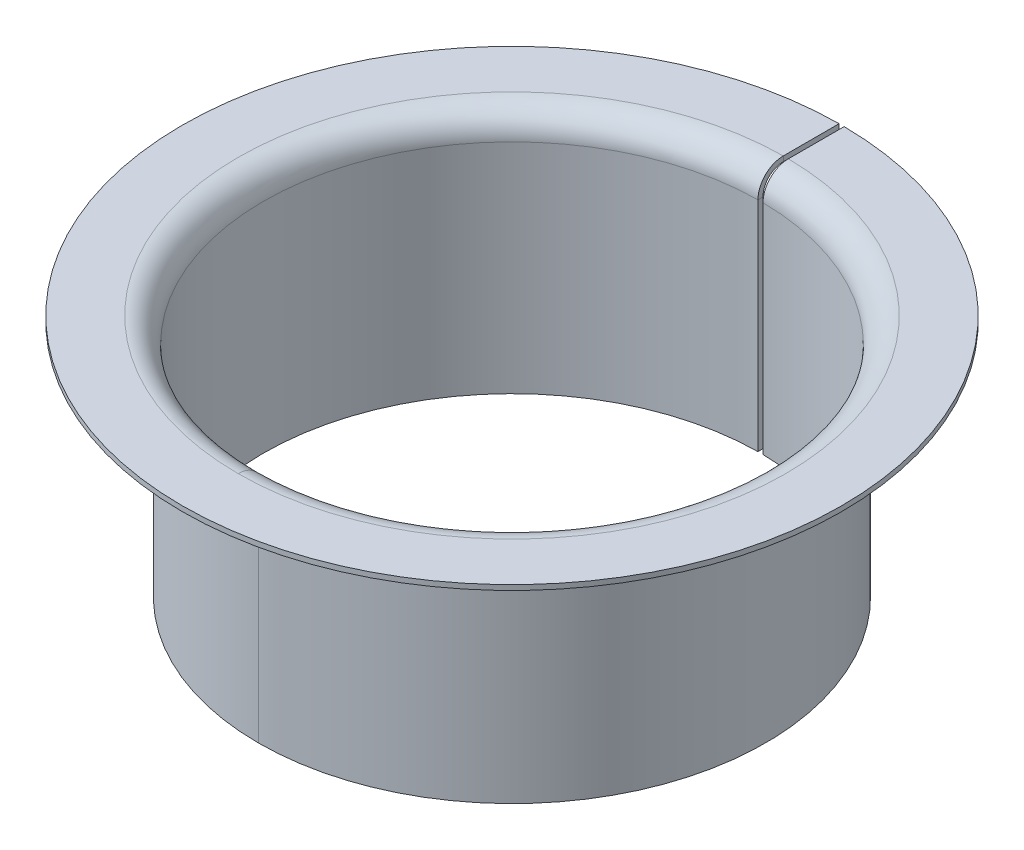
ISO-10303-21;
HEADER;
FILE_DESCRIPTION(('STEP AP214'),'2;1');
FILE_NAME('part.step','',(''),(''),'','','');
FILE_SCHEMA(('AUTOMOTIVE_DESIGN { 1 0 10303 214 1 1 1 1 }'));
ENDSEC;
DATA;
#1=APPLICATION_CONTEXT('core data for automotive mechanical design processes');
#2=APPLICATION_PROTOCOL_DEFINITION('international standard','automotive_design',2000,#1);
#3=PRODUCT_CONTEXT('',#1,'mechanical');
#4=PRODUCT('Part','Part','',(#3));
#5=PRODUCT_RELATED_PRODUCT_CATEGORY('part','',(#4));
#6=PRODUCT_DEFINITION_FORMATION('','',#4);
#7=PRODUCT_DEFINITION_CONTEXT('part definition',#1,'design');
#8=PRODUCT_DEFINITION('design','',#6,#7);
#9=PRODUCT_DEFINITION_SHAPE('','',#8);
#10=(LENGTH_UNIT() NAMED_UNIT(*) SI_UNIT(.MILLI.,.METRE.));
#11=(NAMED_UNIT(*) PLANE_ANGLE_UNIT() SI_UNIT($,.RADIAN.));
#12=(NAMED_UNIT(*) SI_UNIT($,.STERADIAN.) SOLID_ANGLE_UNIT());
#13=UNCERTAINTY_MEASURE_WITH_UNIT(LENGTH_MEASURE(1.E-05),#10,'distance_accuracy_value','');
#14=(GEOMETRIC_REPRESENTATION_CONTEXT(3) GLOBAL_UNCERTAINTY_ASSIGNED_CONTEXT((#13)) GLOBAL_UNIT_ASSIGNED_CONTEXT((#10,
#11,#12)) REPRESENTATION_CONTEXT('',''));
#15=CARTESIAN_POINT('',(0.,0.,0.));
#16=DIRECTION('',(0.,0.,1.));
#17=DIRECTION('',(1.,0.,0.));
#18=AXIS2_PLACEMENT_3D('',#15,#16,#17);
#19=CARTESIAN_POINT('',(0.,1.,0.));
#20=DIRECTION('',(0.,1.,0.));
#21=DIRECTION('',(0.,0.,1.));
#22=AXIS2_PLACEMENT_3D('',#19,#20,#21);
#23=PLANE('',#22);
#24=CARTESIAN_POINT('',(0.,1.,0.));
#25=DIRECTION('',(0.,1.,0.));
#26=DIRECTION('',(0.,0.,1.));
#27=AXIS2_PLACEMENT_3D('',#24,#25,#26);
#28=CIRCLE('',#27,54.);
#29=CARTESIAN_POINT('',(-0.500000000000004,1.,-53.9976851355686));
#30=VERTEX_POINT('',#29);
#31=CARTESIAN_POINT('',(0.,1.,54.));
#32=VERTEX_POINT('',#31);
#33=EDGE_CURVE('E217',#30,#32,#28,.T.);
#34=ORIENTED_EDGE('',*,*,#33,.F.);
#35=DIRECTION('',(0.,0.,1.));
#36=VECTOR('',#35,1.);
#37=CARTESIAN_POINT('',(-0.5,1.,-65.));
#38=LINE('',#37,#36);
#39=CARTESIAN_POINT('',(-0.5,1.,-64.9980768946282));
#40=VERTEX_POINT('',#39);
#41=EDGE_CURVE('E110',#40,#30,#38,.T.);
#42=ORIENTED_EDGE('',*,*,#41,.F.);
#43=CARTESIAN_POINT('',(0.,1.,0.));
#44=DIRECTION('',(0.,1.,0.));
#45=DIRECTION('',(0.,0.,1.));
#46=AXIS2_PLACEMENT_3D('',#43,#44,#45);
#47=CIRCLE('',#46,65.);
#48=CARTESIAN_POINT('',(0.5,1.,-64.9980768946282));
#49=VERTEX_POINT('',#48);
#50=EDGE_CURVE('E226',#40,#49,#47,.T.);
#51=ORIENTED_EDGE('',*,*,#50,.T.);
#52=DIRECTION('',(0.,0.,1.));
#53=VECTOR('',#52,1.);
#54=CARTESIAN_POINT('',(0.5,1.,-65.));
#55=LINE('',#54,#53);
#56=CARTESIAN_POINT('',(0.5,1.,-53.9976851355686));
#57=VERTEX_POINT('',#56);
#58=EDGE_CURVE('E240',#49,#57,#55,.T.);
#59=ORIENTED_EDGE('',*,*,#58,.T.);
#60=EDGE_CURVE('E364',#32,#57,#28,.T.);
#61=ORIENTED_EDGE('',*,*,#60,.F.);
#62=EDGE_LOOP('',(#34,#42,#51,#59,#61));
#63=FACE_BOUND('',#62,.T.);
#64=ADVANCED_FACE('F88',(#63),#23,.T.);
#65=CARTESIAN_POINT('',(0.,0.,0.));
#66=DIRECTION('',(0.,1.,0.));
#67=DIRECTION('',(0.,0.,1.));
#68=AXIS2_PLACEMENT_3D('',#65,#66,#67);
#69=PLANE('',#68);
#70=DIRECTION('',(0.,0.,1.));
#71=VECTOR('',#70,1.);
#72=CARTESIAN_POINT('',(-0.5,0.,0.));
#73=LINE('',#72,#71);
#74=CARTESIAN_POINT('',(-0.5,0.,-64.9980768946282));
#75=VERTEX_POINT('',#74);
#76=CARTESIAN_POINT('',(-0.5,0.,-53.9976851355686));
#77=VERTEX_POINT('',#76);
#78=EDGE_CURVE('E289',#75,#77,#73,.T.);
#79=ORIENTED_EDGE('',*,*,#78,.T.);
#80=CARTESIAN_POINT('',(0.,0.,0.));
#81=DIRECTION('',(0.,1.,0.));
#82=DIRECTION('',(0.,0.,1.));
#83=AXIS2_PLACEMENT_3D('',#80,#81,#82);
#84=CIRCLE('',#83,54.);
#85=CARTESIAN_POINT('',(0.,0.,54.));
#86=VERTEX_POINT('',#85);
#87=EDGE_CURVE('E12',#86,#77,#84,.F.);
#88=ORIENTED_EDGE('',*,*,#87,.F.);
#89=CARTESIAN_POINT('',(0.5,0.,-53.9976851355686));
#90=VERTEX_POINT('',#89);
#91=EDGE_CURVE('E102',#90,#86,#84,.F.);
#92=ORIENTED_EDGE('',*,*,#91,.F.);
#93=DIRECTION('',(0.,0.,1.));
#94=VECTOR('',#93,1.);
#95=CARTESIAN_POINT('',(0.5,0.,0.));
#96=LINE('',#95,#94);
#97=CARTESIAN_POINT('',(0.5,0.,-64.9980768946282));
#98=VERTEX_POINT('',#97);
#99=EDGE_CURVE('E281',#98,#90,#96,.T.);
#100=ORIENTED_EDGE('',*,*,#99,.F.);
#101=CARTESIAN_POINT('',(0.,0.,0.));
#102=DIRECTION('',(0.,1.,0.));
#103=DIRECTION('',(0.,0.,1.));
#104=AXIS2_PLACEMENT_3D('',#101,#102,#103);
#105=CIRCLE('',#104,65.);
#106=EDGE_CURVE('E208',#75,#98,#105,.T.);
#107=ORIENTED_EDGE('',*,*,#106,.F.);
#108=EDGE_LOOP('',(#79,#88,#92,#100,#107));
#109=FACE_BOUND('',#108,.T.);
#110=ADVANCED_FACE('F324',(#109),#69,.F.);
#111=CARTESIAN_POINT('',(0.,1.,0.));
#112=DIRECTION('',(0.,-1.,0.));
#113=DIRECTION('',(0.,0.,-1.));
#114=AXIS2_PLACEMENT_3D('',#111,#112,#113);
#115=CYLINDRICAL_SURFACE('',#114,65.);
#116=DIRECTION('',(0.,1.,0.));
#117=VECTOR('',#116,1.);
#118=CARTESIAN_POINT('',(-0.5,1.,-64.9980768946282));
#119=LINE('',#118,#117);
#120=EDGE_CURVE('E286',#40,#75,#119,.F.);
#121=ORIENTED_EDGE('',*,*,#120,.T.);
#122=ORIENTED_EDGE('',*,*,#106,.T.);
#123=DIRECTION('',(0.,1.,0.));
#124=VECTOR('',#123,1.);
#125=CARTESIAN_POINT('',(0.5,1.,-64.9980768946282));
#126=LINE('',#125,#124);
#127=EDGE_CURVE('E316',#49,#98,#126,.F.);
#128=ORIENTED_EDGE('',*,*,#127,.F.);
#129=ORIENTED_EDGE('',*,*,#50,.F.);
#130=EDGE_LOOP('',(#121,#122,#128,#129));
#131=FACE_BOUND('',#130,.T.);
#132=ADVANCED_FACE('F90',(#131),#115,.T.);
#133=CARTESIAN_POINT('',(0.,-47.,0.));
#134=DIRECTION('',(0.,-1.,0.));
#135=DIRECTION('',(0.,0.,-1.));
#136=AXIS2_PLACEMENT_3D('',#133,#134,#135);
#137=PLANE('',#136);
#138=CARTESIAN_POINT('',(0.,-47.,0.));
#139=DIRECTION('',(0.,1.,0.));
#140=DIRECTION('',(0.,0.,1.));
#141=AXIS2_PLACEMENT_3D('',#138,#139,#140);
#142=CIRCLE('',#141,50.0000000000002);
#143=CARTESIAN_POINT('',(-0.510204081632656,-47.,-49.9973968501871));
#144=VERTEX_POINT('',#143);
#145=CARTESIAN_POINT('',(0.,-47.,50.0000000000002));
#146=VERTEX_POINT('',#145);
#147=EDGE_CURVE('E205',#144,#146,#142,.T.);
#148=ORIENTED_EDGE('',*,*,#147,.F.);
#149=DIRECTION('',(0.0102040816326532,0.,0.999947937003739));
#150=VECTOR('',#149,1.);
#151=CARTESIAN_POINT('',(-0.500000000000006,-47.,-48.9974489131833));
#152=LINE('',#151,#150);
#153=CARTESIAN_POINT('',(-0.500000000000006,-47.,-48.9974489131833));
#154=VERTEX_POINT('',#153);
#155=EDGE_CURVE('E199',#154,#144,#152,.F.);
#156=ORIENTED_EDGE('',*,*,#155,.F.);
#157=CARTESIAN_POINT('',(0.,-47.,0.));
#158=DIRECTION('',(0.,1.,0.));
#159=DIRECTION('',(0.,0.,1.));
#160=AXIS2_PLACEMENT_3D('',#157,#158,#159);
#161=CIRCLE('',#160,49.0000000000001);
#162=CARTESIAN_POINT('',(0.,-47.,49.0000000000001));
#163=VERTEX_POINT('',#162);
#164=EDGE_CURVE('E222',#154,#163,#161,.T.);
#165=ORIENTED_EDGE('',*,*,#164,.T.);
#166=DIRECTION('',(0.,0.,1.));
#167=VECTOR('',#166,1.);
#168=CARTESIAN_POINT('',(0.,-47.,50.0000000000002));
#169=LINE('',#168,#167);
#170=EDGE_CURVE('E204',#163,#146,#169,.T.);
#171=ORIENTED_EDGE('',*,*,#170,.T.);
#172=EDGE_LOOP('',(#148,#156,#165,#171));
#173=FACE_BOUND('',#172,.T.);
#174=ADVANCED_FACE('F349',(#173),#137,.T.);
#175=CARTESIAN_POINT('',(0.500000000000006,-47.,-48.9974489131833));
#176=VERTEX_POINT('',#175);
#177=EDGE_CURVE('E198',#163,#176,#161,.T.);
#178=ORIENTED_EDGE('',*,*,#177,.T.);
#179=DIRECTION('',(-0.0102040816326532,0.,0.999947937003739));
#180=VECTOR('',#179,1.);
#181=CARTESIAN_POINT('',(0.500000000000006,-47.,-48.9974489131833));
#182=LINE('',#181,#180);
#183=CARTESIAN_POINT('',(0.510204081632668,-47.,-49.9973968501871));
#184=VERTEX_POINT('',#183);
#185=EDGE_CURVE('E181',#176,#184,#182,.F.);
#186=ORIENTED_EDGE('',*,*,#185,.T.);
#187=EDGE_CURVE('E195',#146,#184,#142,.T.);
#188=ORIENTED_EDGE('',*,*,#187,.F.);
#189=ORIENTED_EDGE('',*,*,#170,.F.);
#190=EDGE_LOOP('',(#178,#186,#188,#189));
#191=FACE_BOUND('',#190,.T.);
#192=ADVANCED_FACE('F193',(#191),#137,.T.);
#193=CARTESIAN_POINT('',(0.,0.,0.));
#194=DIRECTION('',(0.,1.,0.));
#195=DIRECTION('',(0.,0.,1.));
#196=AXIS2_PLACEMENT_3D('',#193,#194,#195);
#197=CYLINDRICAL_SURFACE('',#196,50.0000000000001);
#198=CARTESIAN_POINT('',(0.,-4.00000000000001,0.));
#199=DIRECTION('',(0.,1.,0.));
#200=DIRECTION('',(0.,0.,1.));
#201=AXIS2_PLACEMENT_3D('',#198,#199,#200);
#202=CIRCLE('',#201,50.);
#203=CARTESIAN_POINT('',(-0.510204081632634,-4.00000000000002,-49.9973968501871));
#204=VERTEX_POINT('',#203);
#205=CARTESIAN_POINT('',(0.,-4.00000000000001,50.));
#206=VERTEX_POINT('',#205);
#207=EDGE_CURVE('E329',#204,#206,#202,.T.);
#208=ORIENTED_EDGE('',*,*,#207,.F.);
#209=DIRECTION('',(0.,1.,0.));
#210=VECTOR('',#209,1.);
#211=CARTESIAN_POINT('',(-0.510204081632634,0.,-49.9973968501871));
#212=LINE('',#211,#210);
#213=EDGE_CURVE('E187',#144,#204,#212,.T.);
#214=ORIENTED_EDGE('',*,*,#213,.F.);
#215=ORIENTED_EDGE('',*,*,#147,.T.);
#216=DIRECTION('',(0.,-1.,0.));
#217=VECTOR('',#216,1.);
#218=CARTESIAN_POINT('',(0.,0.,50.));
#219=LINE('',#218,#217);
#220=EDGE_CURVE('E203',#206,#146,#219,.T.);
#221=ORIENTED_EDGE('',*,*,#220,.F.);
#222=EDGE_LOOP('',(#208,#214,#215,#221));
#223=FACE_BOUND('',#222,.T.);
#224=ADVANCED_FACE('F347',(#223),#197,.T.);
#225=ORIENTED_EDGE('',*,*,#187,.T.);
#226=DIRECTION('',(0.,1.,0.));
#227=VECTOR('',#226,1.);
#228=CARTESIAN_POINT('',(0.510204081632646,0.,-49.9973968501871));
#229=LINE('',#228,#227);
#230=CARTESIAN_POINT('',(0.51020408163265,-4.00000000000001,-49.997396850187));
#231=VERTEX_POINT('',#230);
#232=EDGE_CURVE('E178',#231,#184,#229,.F.);
#233=ORIENTED_EDGE('',*,*,#232,.F.);
#234=EDGE_CURVE('E210',#206,#231,#202,.T.);
#235=ORIENTED_EDGE('',*,*,#234,.F.);
#236=ORIENTED_EDGE('',*,*,#220,.T.);
#237=EDGE_LOOP('',(#225,#233,#235,#236));
#238=FACE_BOUND('',#237,.T.);
#239=ADVANCED_FACE('F201',(#238),#197,.T.);
#240=CARTESIAN_POINT('',(0.,-4.,0.));
#241=DIRECTION('',(0.,1.,0.));
#242=DIRECTION('',(0.,0.,1.));
#243=AXIS2_PLACEMENT_3D('',#240,#241,#242);
#244=TOROIDAL_SURFACE('',#243,54.,4.);
#245=ORIENTED_EDGE('',*,*,#87,.T.);
#246=CARTESIAN_POINT('',(-0.510204081632654,-4.00000000000001,-49.997396850187));
#247=CARTESIAN_POINT('',(-0.510204608599861,-3.88750221436657,-49.9973860592099));
#248=CARTESIAN_POINT('',(-0.510191330153891,-3.77500954174861,-50.0021430952461));
#249=CARTESIAN_POINT('',(-0.510137948795368,-3.55082909363987,-50.0211093481219));
#250=CARTESIAN_POINT('',(-0.510097847174692,-3.43914127964677,-50.0353181097408));
#251=CARTESIAN_POINT('',(-0.50999164599895,-3.21743830506646,-50.0730900318977));
#252=CARTESIAN_POINT('',(-0.509925566177011,-3.10742194056909,-50.0966460923236));
#253=CARTESIAN_POINT('',(-0.509768375379814,-2.88979144536,-50.152921448527));
#254=CARTESIAN_POINT('',(-0.509677264709022,-2.78217728544591,-50.1856406328475));
#255=CARTESIAN_POINT('',(-0.509367347089988,-2.46397563002052,-50.2972786571089));
#256=CARTESIAN_POINT('',(-0.509111911123008,-2.25793953218124,-50.3896932855757));
#257=CARTESIAN_POINT('',(-0.508514279035138,-1.86445715086264,-50.6077383109386));
#258=CARTESIAN_POINT('',(-0.508172098126565,-1.67700761589869,-50.7333628840272));
#259=CARTESIAN_POINT('',(-0.507416263873866,-1.32581662979236,-51.0143105679118));
#260=CARTESIAN_POINT('',(-0.507002607402874,-1.16207621643794,-51.1696349780293));
#261=CARTESIAN_POINT('',(-0.506119664606308,-0.862969228264592,-51.5056000475817));
#262=CARTESIAN_POINT('',(-0.505650367402667,-0.727608216140366,-51.6862456587114));
#263=CARTESIAN_POINT('',(-0.504673816047311,-0.489101874737108,-52.0677295907838));
#264=CARTESIAN_POINT('',(-0.50416655155812,-0.385965359166565,-52.2685734163111));
#265=CARTESIAN_POINT('',(-0.503131859526932,-0.214926747044468,-52.6846851773541));
#266=CARTESIAN_POINT('',(-0.502604443969048,-0.147004048059428,-52.8999445953465));
#267=CARTESIAN_POINT('',(-0.501727878913098,-0.0651888382374459,-53.2633804460958));
#268=CARTESIAN_POINT('',(-0.501379564941497,-0.0407578235355132,-53.4092716409691));
#269=CARTESIAN_POINT('',(-0.50068632924044,-0.00816552820831598,-53.7026498906533));
#270=CARTESIAN_POINT('',(-0.500341403395634,1.88109308374198E-05,-53.8501343845781));
#271=CARTESIAN_POINT('',(-0.5,0.,-53.9976851355686));
#272=B_SPLINE_CURVE_WITH_KNOTS('',3,(#246,#247,#248,#249,#250,#251,#252,#253,#254,#255,#256,
#257,#258,#259,#260,#261,#262,#263,#264,#265,#266,#267,#268,#269,#270,#271),.UNSPECIFIED.,.F.,
.F.,(4,2,2,2,2,2,2,2,2,2,2,2,4),(0.,0.33738359344263,0.674750938751962,1.01186251233612,
1.34896998559401,2.02291617390135,2.69674425504787,3.37060182186776,4.04459134942267,
4.71876505852475,5.39254388460378,5.83547061733613,6.27776826412548),.UNSPECIFIED.);
#273=EDGE_CURVE('E293',#204,#77,#272,.T.);
#274=ORIENTED_EDGE('',*,*,#273,.F.);
#275=ORIENTED_EDGE('',*,*,#207,.T.);
#276=CARTESIAN_POINT('',(0.,-4.,54.));
#277=DIRECTION('',(1.,0.,0.));
#278=DIRECTION('',(0.,1.,0.));
#279=AXIS2_PLACEMENT_3D('',#276,#277,#278);
#280=CIRCLE('',#279,4.);
#281=EDGE_CURVE('E224',#86,#206,#280,.F.);
#282=ORIENTED_EDGE('',*,*,#281,.F.);
#283=EDGE_LOOP('',(#245,#274,#275,#282));
#284=FACE_BOUND('',#283,.T.);
#285=ADVANCED_FACE('F327',(#284),#244,.F.);
#286=ORIENTED_EDGE('',*,*,#234,.T.);
#287=CARTESIAN_POINT('',(0.5,0.,-53.9976851355686));
#288=CARTESIAN_POINT('',(0.500260459615837,1.07765841239984E-05,-53.8851638321645));
#289=CARTESIAN_POINT('',(0.500522963995087,-0.004747242263799,-53.7726476446518));
#290=CARTESIAN_POINT('',(0.501050184250704,-0.0237174357831521,-53.5484203044062));
#291=CARTESIAN_POINT('',(0.501314900020531,-0.0379291575667381,-53.4367091133685));
#292=CARTESIAN_POINT('',(0.501844490605398,-0.0757090882607239,-53.2149592697666));
#293=CARTESIAN_POINT('',(0.502109365150019,-0.0992702342312052,-53.1049194196069));
#294=CARTESIAN_POINT('',(0.502637406970741,-0.155557930877496,-52.8872425204207));
#295=CARTESIAN_POINT('',(0.502900574267657,-0.188284369599646,-52.7796054420617));
#296=CARTESIAN_POINT('',(0.503684629675759,-0.299947245303518,-52.4613372001554));
#297=CARTESIAN_POINT('',(0.504200287835014,-0.392382744560087,-52.2552585187945));
#298=CARTESIAN_POINT('',(0.505198811102179,-0.610479270627938,-51.8616969845265));
#299=CARTESIAN_POINT('',(0.505681681981653,-0.736134430607046,-51.6742108560721));
#300=CARTESIAN_POINT('',(0.506597716333862,-1.01714184512332,-51.3229710029992));
#301=CARTESIAN_POINT('',(0.507030881794816,-1.17249291116005,-51.1592163290528));
#302=CARTESIAN_POINT('',(0.507829991991668,-1.50851712760324,-50.8600899562787));
#303=CARTESIAN_POINT('',(0.508195923572625,-1.68919522131502,-50.7247238112023));
#304=CARTESIAN_POINT('',(0.508845730033316,-2.07072072788876,-50.4862377293547));
#305=CARTESIAN_POINT('',(0.509129594477198,-2.27157070148334,-50.3831218934732));
#306=CARTESIAN_POINT('',(0.509603447825301,-2.68769278559975,-50.2121305778528));
#307=CARTESIAN_POINT('',(0.509793491822168,-2.90295634772024,-50.1442344154498));
#308=CARTESIAN_POINT('',(0.510020954853714,-3.26628256746571,-50.062494494137));
#309=CARTESIAN_POINT('',(0.51008836885418,-3.41205840231098,-50.0380976385707));
#310=CARTESIAN_POINT('',(0.510178957757494,-3.70520244328376,-50.0055509692681));
#311=CARTESIAN_POINT('',(0.510202195374824,-3.85256809289425,-49.9973781225785));
#312=CARTESIAN_POINT('',(0.510204081632654,-4.00000000000001,-49.997396850187));
#313=B_SPLINE_CURVE_WITH_KNOTS('',3,(#287,#288,#289,#290,#291,#292,#293,#294,#295,#296,#297,
#298,#299,#300,#301,#302,#303,#304,#305,#306,#307,#308,#309,#310,#311,#312),.UNSPECIFIED.,.F.,
.F.,(4,2,2,2,2,2,2,2,2,2,2,2,4),(0.,0.337455035176911,0.674893905441599,1.01207834431412,
1.34925866467271,2.02334728789871,2.69731694163775,3.3712596271616,4.04533403580923,
4.71949412369877,5.39325786330703,5.83582698099003,6.27776734009259),.UNSPECIFIED.);
#314=EDGE_CURVE('E294',#90,#231,#313,.T.);
#315=ORIENTED_EDGE('',*,*,#314,.F.);
#316=ORIENTED_EDGE('',*,*,#91,.T.);
#317=ORIENTED_EDGE('',*,*,#281,.T.);
#318=EDGE_LOOP('',(#286,#315,#316,#317));
#319=FACE_BOUND('',#318,.T.);
#320=ADVANCED_FACE('F321',(#319),#244,.F.);
#321=CARTESIAN_POINT('',(0.,0.,0.));
#322=DIRECTION('',(0.,1.,0.));
#323=DIRECTION('',(0.,0.,1.));
#324=AXIS2_PLACEMENT_3D('',#321,#322,#323);
#325=CYLINDRICAL_SURFACE('',#324,49.0000000000001);
#326=DIRECTION('',(0.,1.,0.));
#327=VECTOR('',#326,1.);
#328=CARTESIAN_POINT('',(-0.500000000000001,0.,-48.9974489131833));
#329=LINE('',#328,#327);
#330=CARTESIAN_POINT('',(-0.500000000000001,-4.00000000000002,-48.9974489131832));
#331=VERTEX_POINT('',#330);
#332=EDGE_CURVE('E188',#154,#331,#329,.T.);
#333=ORIENTED_EDGE('',*,*,#332,.T.);
#334=CARTESIAN_POINT('',(0.,-4.00000000000002,0.));
#335=DIRECTION('',(0.,1.,0.));
#336=DIRECTION('',(0.,0.,1.));
#337=AXIS2_PLACEMENT_3D('',#334,#335,#336);
#338=CIRCLE('',#337,49.);
#339=CARTESIAN_POINT('',(0.,-4.00000000000002,49.));
#340=VERTEX_POINT('',#339);
#341=EDGE_CURVE('E223',#331,#340,#338,.T.);
#342=ORIENTED_EDGE('',*,*,#341,.T.);
#343=DIRECTION('',(0.,1.,0.));
#344=VECTOR('',#343,1.);
#345=CARTESIAN_POINT('',(0.,0.,49.0000000000001));
#346=LINE('',#345,#344);
#347=EDGE_CURVE('E214',#340,#163,#346,.F.);
#348=ORIENTED_EDGE('',*,*,#347,.T.);
#349=ORIENTED_EDGE('',*,*,#164,.F.);
#350=EDGE_LOOP('',(#333,#342,#348,#349));
#351=FACE_BOUND('',#350,.T.);
#352=ADVANCED_FACE('F353',(#351),#325,.F.);
#353=DIRECTION('',(0.,1.,0.));
#354=VECTOR('',#353,1.);
#355=CARTESIAN_POINT('',(0.500000000000001,0.,-48.9974489131833));
#356=LINE('',#355,#354);
#357=CARTESIAN_POINT('',(0.500000000000001,-4.00000000000002,-48.9974489131832));
#358=VERTEX_POINT('',#357);
#359=EDGE_CURVE('E338',#358,#176,#356,.F.);
#360=ORIENTED_EDGE('',*,*,#359,.T.);
#361=ORIENTED_EDGE('',*,*,#177,.F.);
#362=ORIENTED_EDGE('',*,*,#347,.F.);
#363=EDGE_CURVE('E219',#340,#358,#338,.T.);
#364=ORIENTED_EDGE('',*,*,#363,.T.);
#365=EDGE_LOOP('',(#360,#361,#362,#364));
#366=FACE_BOUND('',#365,.T.);
#367=ADVANCED_FACE('F357',(#366),#325,.F.);
#368=CARTESIAN_POINT('',(0.,-4.,0.));
#369=DIRECTION('',(0.,1.,0.));
#370=DIRECTION('',(0.,0.,1.));
#371=AXIS2_PLACEMENT_3D('',#368,#369,#370);
#372=TOROIDAL_SURFACE('',#371,54.,5.);
#373=CARTESIAN_POINT('',(-0.500000000000001,-4.00000000000002,-48.9974489131832));
#374=CARTESIAN_POINT('',(-0.500000485850465,-3.85937658750701,-48.9974337815123));
#375=CARTESIAN_POINT('',(-0.500000603722047,-3.71875534855247,-49.0033810641214));
#376=CARTESIAN_POINT('',(-0.500000510637468,-3.43851900275077,-49.0270911985487));
#377=CARTESIAN_POINT('',(-0.500000299697118,-3.29890384785248,-49.0448534822443));
#378=CARTESIAN_POINT('',(-0.499999956217206,-3.0217726994681,-49.0920664978997));
#379=CARTESIAN_POINT('',(-0.499999823618403,-2.88425519658944,-49.1215083694544));
#380=CARTESIAN_POINT('',(-0.499999838987245,-2.61218939513633,-49.1918663208013));
#381=CARTESIAN_POINT('',(-0.499999986951474,-2.47764106040961,-49.2327822608033));
#382=CARTESIAN_POINT('',(-0.500000082953525,-2.21242768183613,-49.32581309149));
#383=CARTESIAN_POINT('',(-0.500000030930956,-2.08176382301002,-49.3779313605133));
#384=CARTESIAN_POINT('',(-0.500000250449607,-1.82524301506301,-49.4930099707042));
#385=CARTESIAN_POINT('',(-0.500000522110431,-1.69938786054526,-49.5559743122466));
#386=CARTESIAN_POINT('',(-0.500000459456976,-1.45349772625527,-49.6922467176778));
#387=CARTESIAN_POINT('',(-0.500000125472686,-1.3334596136118,-49.7655491287275));
#388=CARTESIAN_POINT('',(-0.499999873586854,-1.09993991897083,-49.9220314467239));
#389=CARTESIAN_POINT('',(-0.499999955838614,-0.986460768235633,-50.005214981919));
#390=CARTESIAN_POINT('',(-0.500000023134156,-0.766951457564532,-50.1808161850369));
#391=CARTESIAN_POINT('',(-0.500000008211318,-0.660918752479693,-50.2732306714592));
#392=CARTESIAN_POINT('',(-0.50000002236992,-0.456974684577304,-50.4666969920223));
#393=CARTESIAN_POINT('',(-0.500000051467754,-0.359066361842497,-50.5677520309297));
#394=CARTESIAN_POINT('',(-0.499999992643811,-0.172126943220119,-50.7777335391244));
#395=CARTESIAN_POINT('',(-0.499999904741687,-0.0830943591224876,-50.8866586835173));
#396=CARTESIAN_POINT('',(-0.499999903100626,0.0855096111739941,-51.1116610815334));
#397=CARTESIAN_POINT('',(-0.499999989423639,0.16507762136702,-51.2277408649295));
#398=CARTESIAN_POINT('',(-0.500000038943617,0.314154663272331,-51.4661999943426));
#399=CARTESIAN_POINT('',(-0.500000002132693,0.383663050244359,-51.5885797434555));
#400=CARTESIAN_POINT('',(-0.499999958903888,0.512120601251002,-51.8387601830295));
#401=CARTESIAN_POINT('',(-0.499999952486137,0.571069719673678,-51.9665608969041));
#402=CARTESIAN_POINT('',(-0.500000048532369,0.677963966245401,-52.226617830368));
#403=CARTESIAN_POINT('',(-0.500000150944044,0.725914367485447,-52.3588718798797));
#404=CARTESIAN_POINT('',(-0.500000173138618,0.810495541323594,-52.6268996015879));
#405=CARTESIAN_POINT('',(-0.500000092961292,0.847128777293886,-52.7626725008636));
#406=CARTESIAN_POINT('',(-0.499999931662052,0.91851141416353,-53.0798856836149));
#407=CARTESIAN_POINT('',(-0.499999858126461,0.949068604475796,-53.262296670501));
#408=CARTESIAN_POINT('',(-0.499999894208923,0.979623832581484,-53.5373782423204));
#409=CARTESIAN_POINT('',(-0.499999930578881,0.987262142298707,-53.6292695791642));
#410=CARTESIAN_POINT('',(-0.499999990389203,0.997449611791915,-53.8133281173895));
#411=CARTESIAN_POINT('',(-0.500000013830386,0.999999094181291,-53.9054953009121));
#412=CARTESIAN_POINT('',(-0.5,1.,-53.9976851355686));
#413=B_SPLINE_CURVE_WITH_KNOTS('',3,(#373,#374,#375,#376,#377,#378,#379,#380,#381,#382,#383,
#384,#385,#386,#387,#388,#389,#390,#391,#392,#393,#394,#395,#396,#397,#398,#399,#400,#401,#402,
#403,#404,#405,#406,#407,#408,#409,#410,#411,#412),.UNSPECIFIED.,.F.,.F.,(4,2,2,2,2,2,2,2,2,2,2,
2,2,2,2,2,2,2,2,4),(0.,0.421741465644377,0.843462653381772,1.26486452363039,1.68626126010143,
2.10778525790462,2.52946506130144,2.95091517845299,3.37252052897095,3.79398106890411,
4.21559861162816,4.63714534170606,5.05884198909537,5.48056565186178,5.90229113626667,
6.32381400916422,6.74524506573647,7.29881563852958,7.57532222323892,7.85181127786618),.UNSPECIFIED.);
#414=EDGE_CURVE('E249',#331,#30,#413,.T.);
#415=ORIENTED_EDGE('',*,*,#414,.T.);
#416=ORIENTED_EDGE('',*,*,#33,.T.);
#417=CARTESIAN_POINT('',(0.,-4.,54.));
#418=DIRECTION('',(-1.,0.,0.));
#419=DIRECTION('',(0.,0.,1.));
#420=AXIS2_PLACEMENT_3D('',#417,#418,#419);
#421=CIRCLE('',#420,5.);
#422=EDGE_CURVE('E218',#32,#340,#421,.T.);
#423=ORIENTED_EDGE('',*,*,#422,.T.);
#424=ORIENTED_EDGE('',*,*,#341,.F.);
#425=EDGE_LOOP('',(#415,#416,#423,#424));
#426=FACE_BOUND('',#425,.T.);
#427=ADVANCED_FACE('F374',(#426),#372,.T.);
#428=CARTESIAN_POINT('',(0.5,1.,-53.9976851355686));
#429=CARTESIAN_POINT('',(0.500000028405597,1.00001511960645,-53.8570427695018));
#430=CARTESIAN_POINT('',(0.500000041904285,0.994067060883485,-53.7164025741168));
#431=CARTESIAN_POINT('',(0.500000046429357,0.970353812672553,-53.4361284226315));
#432=CARTESIAN_POINT('',(0.500000037456818,0.952589189467506,-53.2964944186358));
#433=CARTESIAN_POINT('',(0.500000004394743,0.905369840000909,-53.0193254854156));
#434=CARTESIAN_POINT('',(0.499999980316618,0.875923944529382,-52.881789051849));
#435=CARTESIAN_POINT('',(0.499999986147607,0.805556220951072,-52.6096858403458));
#436=CARTESIAN_POINT('',(0.500000016056062,0.76463453300526,-52.4751190261611));
#437=CARTESIAN_POINT('',(0.500000006548064,0.6715903513074,-52.209869217243));
#438=CARTESIAN_POINT('',(0.49999996711061,0.619464468535956,-52.0791874112825));
#439=CARTESIAN_POINT('',(0.499999961975032,0.504368691351167,-51.8226316239842));
#440=CARTESIAN_POINT('',(0.499999996304171,0.441394795642907,-51.6967594376828));
#441=CARTESIAN_POINT('',(0.500000012125154,0.305101317505939,-51.4508365752071));
#442=CARTESIAN_POINT('',(0.499999993645806,0.231787396614119,-51.3307827612774));
#443=CARTESIAN_POINT('',(0.500000006395695,0.0752799800232918,-51.0972332561896));
#444=CARTESIAN_POINT('',(0.500000037643243,-0.00791714447662354,-50.9837399967391));
#445=CARTESIAN_POINT('',(0.499999971372819,-0.18354245513023,-50.7642109290883));
#446=CARTESIAN_POINT('',(0.49999987390662,-0.275966915923759,-50.6581721405188));
#447=CARTESIAN_POINT('',(0.499999988105946,-0.469454262021656,-50.4542173634815));
#448=CARTESIAN_POINT('',(0.500000199886645,-0.570520352552189,-50.3563044156977));
#449=CARTESIAN_POINT('',(0.500000393318811,-0.780525026044576,-50.169357587474));
#450=CARTESIAN_POINT('',(0.500000375008955,-0.889462282870049,-50.0803222173254));
#451=CARTESIAN_POINT('',(0.500000218586661,-1.11448991497595,-49.9117148798517));
#452=CARTESIAN_POINT('',(0.500000080431625,-1.23058282011342,-49.832146288949));
#453=CARTESIAN_POINT('',(0.499999967152719,-1.46905813865888,-49.6830774774118));
#454=CARTESIAN_POINT('',(0.499999992024406,-1.59144038053823,-49.6135769823881));
#455=CARTESIAN_POINT('',(0.499999948359516,-1.84162549079376,-49.4851361815533));
#456=CARTESIAN_POINT('',(0.499999879822545,-1.96942838202908,-49.4261959202807));
#457=CARTESIAN_POINT('',(0.500000122525964,-2.22948912797336,-49.3193206032362));
#458=CARTESIAN_POINT('',(0.500000433583477,-2.36174480761357,-49.271380261229));
#459=CARTESIAN_POINT('',(0.500000649488086,-2.62977525310988,-49.1868205081844));
#460=CARTESIAN_POINT('',(0.500000554423762,-2.76554924516548,-49.1501986303428));
#461=CARTESIAN_POINT('',(0.499999526379188,-3.08267320811075,-49.0788643296421));
#462=CARTESIAN_POINT('',(0.499998340532365,-3.26499126020926,-49.0483345757018));
#463=CARTESIAN_POINT('',(0.499998229945217,-3.5399314563049,-49.017806786818));
#464=CARTESIAN_POINT('',(0.499998470571933,-3.63177533186485,-49.0101753376201));
#465=CARTESIAN_POINT('',(0.499999162918138,-3.81573861116374,-48.9999970144222));
#466=CARTESIAN_POINT('',(0.499999614624292,-3.90785799713095,-48.9974498192581));
#467=CARTESIAN_POINT('',(0.500000000000001,-4.00000000000001,-48.9974489131832));
#468=B_SPLINE_CURVE_WITH_KNOTS('',3,(#428,#429,#430,#431,#432,#433,#434,#435,#436,#437,#438,
#439,#440,#441,#442,#443,#444,#445,#446,#447,#448,#449,#450,#451,#452,#453,#454,#455,#456,#457,
#458,#459,#460,#461,#462,#463,#464,#465,#466,#467),.UNSPECIFIED.,.F.,.F.,(4,2,2,2,2,2,2,2,2,2,2,
2,2,2,2,2,2,2,2,4),(0.,0.421798315915854,0.84357641952936,1.26503627376679,1.6864909806778,
2.10807334809813,2.5298115506529,2.95131972637713,3.3729831477737,3.7944770138373,
4.21612789804769,4.63770790730317,5.05943782942026,5.48115625582545,5.90287646081543,
6.3243935731011,6.74581875289341,7.2991025052572,7.57546563617768,7.85181130913064),.UNSPECIFIED.);
#469=EDGE_CURVE('E246',#57,#358,#468,.T.);
#470=ORIENTED_EDGE('',*,*,#469,.T.);
#471=ORIENTED_EDGE('',*,*,#363,.F.);
#472=ORIENTED_EDGE('',*,*,#422,.F.);
#473=ORIENTED_EDGE('',*,*,#60,.T.);
#474=EDGE_LOOP('',(#470,#471,#472,#473));
#475=FACE_BOUND('',#474,.T.);
#476=ADVANCED_FACE('F361',(#475),#372,.T.);
#477=CARTESIAN_POINT('',(0.5,-0.0100000000000002,-53.9976851355686));
#478=CARTESIAN_POINT('',(0.50060926295406,-0.0100000000000002,-53.7377241996189));
#479=CARTESIAN_POINT('',(0.501227030201624,-0.0351568201021238,-53.4788388059406));
#480=CARTESIAN_POINT('',(0.502166756322074,-0.1118694399146,-53.0921956616706));
#481=CARTESIAN_POINT('',(0.502480320646429,-0.143879466993361,-52.9643680122248));
#482=CARTESIAN_POINT('',(0.503100989972275,-0.219975536207956,-52.7135887107573));
#483=CARTESIAN_POINT('',(0.503409139927148,-0.264142724695523,-52.5902066359587));
#484=CARTESIAN_POINT('',(0.504020600094923,-0.364813261963202,-52.3474897472986));
#485=CARTESIAN_POINT('',(0.504323513105495,-0.421325205303416,-52.2283235819506));
#486=CARTESIAN_POINT('',(0.504913159527834,-0.544577657126702,-51.9982524202218));
#487=CARTESIAN_POINT('',(0.505201285169005,-0.611533362638826,-51.8867928223412));
#488=CARTESIAN_POINT('',(0.505763629969831,-0.755947573196689,-51.6709208220433));
#489=CARTESIAN_POINT('',(0.506037850339859,-0.833406097978641,-51.566508432851));
#490=CARTESIAN_POINT('',(0.50657136416924,-0.998973818110864,-51.3648300804613));
#491=CARTESIAN_POINT('',(0.506831986073796,-1.08759628387578,-51.2670710877065));
#492=CARTESIAN_POINT('',(0.507578416738936,-1.36605153010119,-50.9889439952809));
#493=CARTESIAN_POINT('',(0.508027204633146,-1.56720103862937,-50.8242554638249));
#494=CARTESIAN_POINT('',(0.508623445996499,-1.89159290630181,-50.6075133798287));
#495=CARTESIAN_POINT('',(0.508809285409248,-2.00352858458622,-50.5403507131614));
#496=CARTESIAN_POINT('',(0.509153441810267,-2.23524455843472,-50.4165081528168));
#497=CARTESIAN_POINT('',(0.509310451978583,-2.35427516767904,-50.360299167443));
#498=CARTESIAN_POINT('',(0.509729470163323,-2.71563446523124,-50.2107950803317));
#499=CARTESIAN_POINT('',(0.509942897944928,-2.96417139557063,-50.1353591309727));
#500=CARTESIAN_POINT('',(0.510232370715401,-3.47660247346375,-50.0332582783175));
#501=CARTESIAN_POINT('',(0.510306122448981,-3.74155433349698,-50.007396329557));
#502=CARTESIAN_POINT('',(0.510306122448981,-4.00000000000001,-50.007396329557));
#503=CARTESIAN_POINT('',(0.5,0.,-53.9976851355686));
#504=CARTESIAN_POINT('',(0.500603230647584,0.,-53.7370727384475));
#505=CARTESIAN_POINT('',(0.501214881387747,-0.0252198697765652,-53.4775385808025));
#506=CARTESIAN_POINT('',(0.502145303289182,-0.102124751794086,-53.0899265160395));
#507=CARTESIAN_POINT('',(0.502455763016266,-0.134215004504623,-52.9617785333992));
#508=CARTESIAN_POINT('',(0.503070287101262,-0.210501790684667,-52.7103707856564));
#509=CARTESIAN_POINT('',(0.503375386066483,-0.254779673880224,-52.5866795191452));
#510=CARTESIAN_POINT('',(0.503980792173192,-0.35570251825885,-52.3433543903138));
#511=CARTESIAN_POINT('',(0.504280706045044,-0.412356095542272,-52.2238895991394));
#512=CARTESIAN_POINT('',(0.504864514383994,-0.535917450753586,-51.9932418887982));
#513=CARTESIAN_POINT('',(0.505149787296044,-0.603040965051454,-51.8815029783184));
#514=CARTESIAN_POINT('',(0.505706564326566,-0.747817115986656,-51.6650900135516));
#515=CARTESIAN_POINT('',(0.505978069643425,-0.825469772409665,-51.560415972523));
#516=CARTESIAN_POINT('',(0.506506301157663,-0.991452449233949,-51.3582322257237));
#517=CARTESIAN_POINT('',(0.506764342647323,-1.08029702644188,-51.2602282548962));
#518=CARTESIAN_POINT('',(0.507503382909837,-1.35945015548992,-50.9814041938563));
#519=CARTESIAN_POINT('',(0.50794772735955,-1.56110379812468,-50.8163029647832));
#520=CARTESIAN_POINT('',(0.508538065343068,-1.8863086779968,-50.5990177417586));
#521=CARTESIAN_POINT('',(0.508722064761632,-1.99852489682829,-50.5316867708048));
#522=CARTESIAN_POINT('',(0.509062813673532,-2.23082161246588,-50.4075338711588));
#523=CARTESIAN_POINT('',(0.509218269285726,-2.35015054403914,-50.3511840308281));
#524=CARTESIAN_POINT('',(0.509633138775568,-2.71241550399122,-50.2013052994009));
#525=CARTESIAN_POINT('',(0.50984445341082,-2.96157533390539,-50.125680314453));
#526=CARTESIAN_POINT('',(0.510131060114258,-3.47529070021429,-50.023323606515));
#527=CARTESIAN_POINT('',(0.510204081632654,-3.74090659999697,-49.997396850187));
#528=CARTESIAN_POINT('',(0.510204081632654,-4.00000000000001,-49.997396850187));
#529=CARTESIAN_POINT('',(0.5,1.,-53.9976851355686));
#530=CARTESIAN_POINT('',(0.5,1.,-53.6719266213123));
#531=CARTESIAN_POINT('',(0.5,0.968475162779293,-53.3475160669965));
#532=CARTESIAN_POINT('',(0.5,0.872344060257393,-52.8630119529268));
#533=CARTESIAN_POINT('',(0.5,0.832231244369222,-52.7028306508428));
#534=CARTESIAN_POINT('',(0.5,0.736872761644166,-52.3885782755639));
#535=CARTESIAN_POINT('',(0.5,0.68152540764972,-52.2339678377964));
#536=CARTESIAN_POINT('',(0.5,0.555371852176438,-51.9298186918313));
#537=CARTESIAN_POINT('',(0.500000000000001,0.484554880572161,-51.7804913180159));
#538=CARTESIAN_POINT('',(0.500000000000001,0.330103186558018,-51.4921887464348));
#539=CARTESIAN_POINT('',(0.500000000000001,0.246198793685681,-51.3525185760394));
#540=CARTESIAN_POINT('',(0.500000000000001,0.0652286050166793,-51.0820091643847));
#541=CARTESIAN_POINT('',(0.500000000000001,-0.0318372155120816,-50.9511699397197));
#542=CARTESIAN_POINT('',(0.500000000000001,-0.239315561542436,-50.6984467519597));
#543=CARTESIAN_POINT('',(0.500000000000001,-0.350371283052354,-50.5759449738668));
#544=CARTESIAN_POINT('',(0.500000000000001,-0.699312694362399,-50.2274240513968));
#545=CARTESIAN_POINT('',(0.500000000000001,-0.951379747655851,-50.0210530606075));
#546=CARTESIAN_POINT('',(0.500000000000001,-1.357885847496,-49.7494539347428));
#547=CARTESIAN_POINT('',(0.500000000000001,-1.49815612103536,-49.6652925351394));
#548=CARTESIAN_POINT('',(0.500000000000001,-1.78852701558235,-49.5101057053581));
#549=CARTESIAN_POINT('',(0.500000000000001,-1.93768818004892,-49.4396703693346));
#550=CARTESIAN_POINT('',(0.500000000000001,-2.39051937998903,-49.2523272063268));
#551=CARTESIAN_POINT('',(0.500000000000001,-2.70196916738174,-49.1577986624793));
#552=CARTESIAN_POINT('',(0.500000000000001,-3.34411337526786,-49.0298564262679));
#553=CARTESIAN_POINT('',(0.500000000000001,-3.67613324999622,-48.9974489131832));
#554=CARTESIAN_POINT('',(0.500000000000001,-4.00000000000001,-48.9974489131832));
#555=CARTESIAN_POINT('',(0.5,1.0101,-53.9976851355686));
#556=CARTESIAN_POINT('',(0.49999390737046,1.0101,-53.6712686455292));
#557=CARTESIAN_POINT('',(0.499987729697984,0.978511482608108,-53.3462028396071));
#558=CARTESIAN_POINT('',(0.49997833243678,0.882186195259113,-52.8607201158394));
#559=CARTESIAN_POINT('',(0.499975196793536,0.841992351482848,-52.700215277229));
#560=CARTESIAN_POINT('',(0.499968990100278,0.746441244622688,-52.3853281712119));
#561=CARTESIAN_POINT('',(0.499965908600729,0.690982088973173,-52.2304054498148));
#562=CARTESIAN_POINT('',(0.499959793999051,0.564573703317835,-51.9256419812766));
#563=CARTESIAN_POINT('',(0.499956764868946,0.493613681430917,-51.7760129953766));
#564=CARTESIAN_POINT('',(0.499950868404722,0.338849994994865,-51.4871281096969));
#565=CARTESIAN_POINT('',(0.499947987148311,0.254776115248926,-51.3471758335764));
#566=CARTESIAN_POINT('',(0.499942363700302,0.073440366798813,-51.0761200478081));
#567=CARTESIAN_POINT('',(0.499939621496602,-0.023821526687416,-50.9450165547884));
#568=CARTESIAN_POINT('',(0.499934286358308,-0.231718978976752,-50.6917829186747));
#569=CARTESIAN_POINT('',(0.499931680139263,-0.34299903304412,-50.5690337127284));
#570=CARTESIAN_POINT('',(0.499924215832611,-0.692645306005011,-50.219808851958));
#571=CARTESIAN_POINT('',(0.499919727953669,-0.945221534746116,-50.0130210365753));
#572=CARTESIAN_POINT('',(0.499913765540036,-1.35254877690794,-49.7408733402919));
#573=CARTESIAN_POINT('',(0.499911907145908,-1.49310239639985,-49.6565419533592));
#574=CARTESIAN_POINT('',(0.499908465581898,-1.78405984015383,-49.5010416808836));
#575=CARTESIAN_POINT('',(0.499906895480215,-1.93352231017262,-49.4304640813536));
#576=CARTESIAN_POINT('',(0.499902705298368,-2.3872682291366,-49.2427425275868));
#577=CARTESIAN_POINT('',(0.499900571020552,-2.69934714509985,-49.1480230577944));
#578=CARTESIAN_POINT('',(0.499897676292847,-3.3427884842859,-49.0198224077474));
#579=CARTESIAN_POINT('',(0.499896938775511,-3.67547903916121,-48.9873494390195));
#580=CARTESIAN_POINT('',(0.499896938775511,-4.00000000000001,-48.9873494390195));
#581=B_SPLINE_SURFACE_WITH_KNOTS('',1,3,((#477,#478,#479,#480,#481,#482,#483,#484,#485,#486,
#487,#488,#489,#490,#491,#492,#493,#494,#495,#496,#497,#498,#499,#500,#501,#502),(#503,#504,
#505,#506,#507,#508,#509,#510,#511,#512,#513,#514,#515,#516,#517,#518,#519,#520,#521,#522,#523,
#524,#525,#526,#527,#528),(#529,#530,#531,#532,#533,#534,#535,#536,#537,#538,#539,#540,#541,
#542,#543,#544,#545,#546,#547,#548,#549,#550,#551,#552,#553,#554),(#555,#556,#557,#558,#559,
#560,#561,#562,#563,#564,#565,#566,#567,#568,#569,#570,#571,#572,#573,#574,#575,#576,#577,#578,
#579,#580)),.UNSPECIFIED.,.F.,.F.,.F.,(2,1,1,2),(4,2,2,2,2,2,2,2,2,2,2,2,4),(-0.01,0.,1.,
1.0101),(0.0291652175019248,0.0301416027687631,0.0306297954021822,0.0311179880356014,
0.0316061806690206,0.0320943733024397,0.0325825659358589,0.033070758569278,0.0340471438361163,
0.0345353364695355,0.0350235291029546,0.035999914369793,0.0369762996366313),.UNSPECIFIED.);
#582=DIRECTION('',(0.0102040816326531,0.,-0.999947937003739));
#583=VECTOR('',#582,1.);
#584=CARTESIAN_POINT('',(0.500000000000001,-4.00000000000001,-48.9974489131832));
#585=LINE('',#584,#583);
#586=EDGE_CURVE('E118',#358,#231,#585,.T.);
#587=DIRECTION('',(0.,1.,0.));
#588=VECTOR('',#587,1.);
#589=CARTESIAN_POINT('',(0.5,1.,-53.9976851355686));
#590=LINE('',#589,#588);
#591=EDGE_CURVE('E257',#57,#90,#590,.F.);
#592=ORIENTED_EDGE('',*,*,#586,.F.);
#593=ORIENTED_EDGE('',*,*,#469,.F.);
#594=ORIENTED_EDGE('',*,*,#591,.T.);
#595=ORIENTED_EDGE('',*,*,#314,.T.);
#596=EDGE_LOOP('',(#592,#593,#594,#595));
#597=FACE_BOUND('',#596,.T.);
#598=ADVANCED_FACE('F259',(#597),#581,.F.);
#599=CARTESIAN_POINT('',(0.500000000000001,-25.5,-48.9974489131833));
#600=DIRECTION('',(-0.999947937003739,0.,-0.0102040816326531));
#601=DIRECTION('',(0.,1.,0.));
#602=AXIS2_PLACEMENT_3D('',#599,#600,#601);
#603=PLANE('',#602);
#604=ORIENTED_EDGE('',*,*,#185,.F.);
#605=ORIENTED_EDGE('',*,*,#359,.F.);
#606=ORIENTED_EDGE('',*,*,#586,.T.);
#607=ORIENTED_EDGE('',*,*,#232,.T.);
#608=EDGE_LOOP('',(#604,#605,#606,#607));
#609=FACE_BOUND('',#608,.T.);
#610=ADVANCED_FACE('F180',(#609),#603,.T.);
#611=CARTESIAN_POINT('',(0.5,1.,-65.));
#612=DIRECTION('',(-1.,0.,0.));
#613=DIRECTION('',(0.,0.,1.));
#614=AXIS2_PLACEMENT_3D('',#611,#612,#613);
#615=PLANE('',#614);
#616=ORIENTED_EDGE('',*,*,#58,.F.);
#617=ORIENTED_EDGE('',*,*,#127,.T.);
#618=ORIENTED_EDGE('',*,*,#99,.T.);
#619=ORIENTED_EDGE('',*,*,#591,.F.);
#620=EDGE_LOOP('',(#616,#617,#618,#619));
#621=FACE_BOUND('',#620,.T.);
#622=ADVANCED_FACE('F314',(#621),#615,.T.);
#623=CARTESIAN_POINT('',(-0.5,1.,-65.));
#624=DIRECTION('',(-1.,0.,0.));
#625=DIRECTION('',(0.,0.,1.));
#626=AXIS2_PLACEMENT_3D('',#623,#624,#625);
#627=PLANE('',#626);
#628=ORIENTED_EDGE('',*,*,#120,.F.);
#629=ORIENTED_EDGE('',*,*,#41,.T.);
#630=DIRECTION('',(0.,1.,0.));
#631=VECTOR('',#630,1.);
#632=CARTESIAN_POINT('',(-0.5,1.,-53.9976851355686));
#633=LINE('',#632,#631);
#634=EDGE_CURVE('E284',#30,#77,#633,.F.);
#635=ORIENTED_EDGE('',*,*,#634,.T.);
#636=ORIENTED_EDGE('',*,*,#78,.F.);
#637=EDGE_LOOP('',(#628,#629,#635,#636));
#638=FACE_BOUND('',#637,.T.);
#639=ADVANCED_FACE('F377',(#638),#627,.F.);
#640=CARTESIAN_POINT('',(-0.510306122448981,-4.00000000000001,-50.007396329557));
#641=CARTESIAN_POINT('',(-0.510306122448981,-3.73913008313107,-50.007396329557));
#642=CARTESIAN_POINT('',(-0.510233846154495,-3.48064697999942,-50.0327400473149));
#643=CARTESIAN_POINT('',(-0.510018072582044,-3.09654832738597,-50.1088429866319));
#644=CARTESIAN_POINT('',(-0.509927492976448,-2.96842023705679,-50.1408374383608));
#645=CARTESIAN_POINT('',(-0.509712947133906,-2.71749220382823,-50.2168761896244));
#646=CARTESIAN_POINT('',(-0.509589306302646,-2.59475221847865,-50.2608049451051));
#647=CARTESIAN_POINT('',(-0.50917154434665,-2.23449308287023,-50.4098610099665));
#648=CARTESIAN_POINT('',(-0.508830962989501,-2.00485780135491,-50.5320911837209));
#649=CARTESIAN_POINT('',(-0.508228912282288,-1.67676420670818,-50.7509254603592));
#650=CARTESIAN_POINT('',(-0.508014682451158,-1.5711765832602,-50.8291977669676));
#651=CARTESIAN_POINT('',(-0.50756541502858,-1.3696453799949,-50.9944236148322));
#652=CARTESIAN_POINT('',(-0.507329689602611,-1.27332431051014,-51.081626592136));
#653=CARTESIAN_POINT('',(-0.506837204751434,-1.08948355019658,-51.2651220832944));
#654=CARTESIAN_POINT('',(-0.506580444482743,-1.00196367028374,-51.3614144018926));
#655=CARTESIAN_POINT('',(-0.506046397730807,-0.83589231008609,-51.56326105185));
#656=CARTESIAN_POINT('',(-0.505767884670294,-0.75706161953918,-51.6692901285815));
#657=CARTESIAN_POINT('',(-0.505199557220507,-0.611068299435252,-51.8874535619078));
#658=CARTESIAN_POINT('',(-0.504909179304279,-0.543664273337918,-51.9997938158461));
#659=CARTESIAN_POINT('',(-0.504316770155295,-0.419998635623531,-52.2309664197665));
#660=CARTESIAN_POINT('',(-0.504013347848562,-0.363524410824123,-52.3503531824345));
#661=CARTESIAN_POINT('',(-0.503097832679761,-0.213082078649384,-52.71381005994));
#662=CARTESIAN_POINT('',(-0.502481832815508,-0.13781079434195,-52.9626005568807));
#663=CARTESIAN_POINT('',(-0.501241503678388,-0.0361204866478553,-53.4728436210647));
#664=CARTESIAN_POINT('',(-0.500611881353161,-0.01,-53.7366069784551));
#665=CARTESIAN_POINT('',(-0.5,-0.01,-53.9976851355686));
#666=CARTESIAN_POINT('',(-0.510204081632654,-4.00000000000001,-49.997396850187));
#667=CARTESIAN_POINT('',(-0.510204081632654,-3.7384762738156,-49.997396850187));
#668=CARTESIAN_POINT('',(-0.510132520945044,-3.47934534335782,-50.0228040768747));
#669=CARTESIAN_POINT('',(-0.509918883744598,-3.09428403747966,-50.0990977231091));
#670=CARTESIAN_POINT('',(-0.509829200966781,-2.96583482411708,-50.1311723499962));
#671=CARTESIAN_POINT('',(-0.509616779340501,-2.71427789857467,-50.2074016475259));
#672=CARTESIAN_POINT('',(-0.509494362675887,-2.59123029421419,-50.2514404845715));
#673=CARTESIAN_POINT('',(-0.509080736976881,-2.23006825350399,-50.4008700710438));
#674=CARTESIAN_POINT('',(-0.508743527712377,-1.99985744496733,-50.5234065434224));
#675=CARTESIAN_POINT('',(-0.508147437903255,-1.6709415606097,-50.7427892019532));
#676=CARTESIAN_POINT('',(-0.507935329159563,-1.56508930652651,-50.8212576531588));
#677=CARTESIAN_POINT('',(-0.507490509929287,-1.36305301252622,-50.9868975452964));
#678=CARTESIAN_POINT('',(-0.507257118418427,-1.26649053685227,-51.0743190473433));
#679=CARTESIAN_POINT('',(-0.506769509654885,-1.08218902275347,-51.2582743664021));
#680=CARTESIAN_POINT('',(-0.506515291567073,-0.994449794770665,-51.3548079876681));
#681=CARTESIAN_POINT('',(-0.505986532406739,-0.827962215625153,-51.5571604537631));
#682=CARTESIAN_POINT('',(-0.505710776901282,-0.748933954425243,-51.6634552336546));
#683=CARTESIAN_POINT('',(-0.505148076455947,-0.602574736275942,-51.8821653736642));
#684=CARTESIAN_POINT('',(-0.504860573568593,-0.535001777782374,-51.9947871470894));
#685=CARTESIAN_POINT('',(-0.504274029856727,-0.411026201126347,-52.2265390598007));
#686=CARTESIAN_POINT('',(-0.50397361173125,-0.354410436916414,-52.3462250011127));
#687=CARTESIAN_POINT('',(-0.503067161069071,-0.20359105629011,-52.710592689068));
#688=CARTESIAN_POINT('',(-0.502457260213374,-0.128131122147319,-52.9600066483565));
#689=CARTESIAN_POINT('',(-0.501229211562761,-0.026185951526672,-53.4715283720882));
#690=CARTESIAN_POINT('',(-0.500605823121941,0.,-53.7359527175081));
#691=CARTESIAN_POINT('',(-0.5,0.,-53.9976851355686));
#692=CARTESIAN_POINT('',(-0.500000000000001,-4.00000000000002,-48.9974489131832));
#693=CARTESIAN_POINT('',(-0.500000000000001,-3.6730953422695,-48.9974489131832));
#694=CARTESIAN_POINT('',(-0.500000000000001,-3.34918167919727,-49.0292070328538));
#695=CARTESIAN_POINT('',(-0.500000000000001,-2.86785504684958,-49.1245713708326));
#696=CARTESIAN_POINT('',(-0.500000000000001,-2.70729353014635,-49.1646635135359));
#697=CARTESIAN_POINT('',(-0.500000000000001,-2.39284737321834,-49.2599474376773));
#698=CARTESIAN_POINT('',(-0.500000000000001,-2.23903786776773,-49.3149944312085));
#699=CARTESIAN_POINT('',(-0.500000000000001,-1.78758531687999,-49.5017761787696));
#700=CARTESIAN_POINT('',(-0.500000000000001,-1.49982180620916,-49.6549425135721));
#701=CARTESIAN_POINT('',(-0.500000000000001,-1.08867695076213,-49.9291633613564));
#702=CARTESIAN_POINT('',(-0.500000000000001,-0.956361633158142,-50.0272462722775));
#703=CARTESIAN_POINT('',(-0.500000000000001,-0.703816265657776,-50.2342905917132));
#704=CARTESIAN_POINT('',(-0.500000000000001,-0.583113171065341,-50.3435645680723));
#705=CARTESIAN_POINT('',(-0.500000000000001,-0.352736278441835,-50.5735026771747));
#706=CARTESIAN_POINT('',(-0.500000000000001,-0.243062243463338,-50.694166565218));
#707=CARTESIAN_POINT('',(-0.500000000000001,-0.0349527695314484,-50.947100645075));
#708=CARTESIAN_POINT('',(-0.500000000000001,0.0638325569684465,-51.0799657409599));
#709=CARTESIAN_POINT('',(-0.500000000000001,0.246781579655073,-51.3533465493038));
#710=CARTESIAN_POINT('',(-0.500000000000001,0.331247777772033,-51.4941202714211));
#711=CARTESIAN_POINT('',(-0.500000000000001,0.486217248592067,-51.7838030632166));
#712=CARTESIAN_POINT('',(-0.5,0.556986953854481,-51.933406868933));
#713=CARTESIAN_POINT('',(-0.5,0.745511179637361,-52.3888556018638));
#714=CARTESIAN_POINT('',(-0.5,0.839836097315852,-52.7006157959373));
#715=CARTESIAN_POINT('',(-0.5,0.96726756059166,-53.3400034744434));
#716=CARTESIAN_POINT('',(-0.5,1.,-53.6705266228156));
#717=CARTESIAN_POINT('',(-0.5,1.,-53.9976851355686));
#718=CARTESIAN_POINT('',(-0.499896938775511,-4.00000000000002,-48.9873494390195));
#719=CARTESIAN_POINT('',(-0.499896938775511,-3.67243499486089,-48.9873494390195));
#720=CARTESIAN_POINT('',(-0.499897661538456,-3.34786702618925,-49.0191717027092));
#721=CARTESIAN_POINT('',(-0.49989981927418,-2.86556811404422,-49.1147286546746));
#722=CARTESIAN_POINT('',(-0.499900725070236,-2.70468226307725,-49.1549017742876));
#723=CARTESIAN_POINT('',(-0.499902870528662,-2.38960092491224,-49.2503781501578));
#724=CARTESIAN_POINT('',(-0.499904106936974,-2.23548072426062,-49.3055363260695));
#725=CARTESIAN_POINT('',(-0.499908284556534,-1.78311623922009,-49.4926953304577));
#726=CARTESIAN_POINT('',(-0.499911690370106,-1.49477144625771,-49.6461710268706));
#727=CARTESIAN_POINT('',(-0.499917710877178,-1.08279607820267,-49.9209457403664));
#728=CARTESIAN_POINT('',(-0.499919853175489,-0.950213483657121,-50.0192267573306));
#729=CARTESIAN_POINT('',(-0.499924345849715,-0.697157974514404,-50.226689261482));
#730=CARTESIAN_POINT('',(-0.499926703103975,-0.576211059670893,-50.3361839478317));
#731=CARTESIAN_POINT('',(-0.499931627952486,-0.345368805724287,-50.5665864831135));
#732=CARTESIAN_POINT('',(-0.499934195555173,-0.235473229195134,-50.6874940868512));
#733=CARTESIAN_POINT('',(-0.499939536022693,-0.026943374125902,-50.9409390410073));
#734=CARTESIAN_POINT('',(-0.499942321153298,0.0720414987335228,-51.0740724970836));
#735=CARTESIAN_POINT('',(-0.499948004427796,0.255360078445976,-51.3480054791778));
#736=CARTESIAN_POINT('',(-0.499950908206958,0.339996898283132,-51.4890635359768));
#737=CARTESIAN_POINT('',(-0.499956832298448,0.495279407434223,-51.7793314296511));
#738=CARTESIAN_POINT('',(-0.499959866521515,0.566192067501267,-51.9292374057979));
#739=CARTESIAN_POINT('',(-0.499969021673203,0.755097112220229,-52.385606057283));
#740=CARTESIAN_POINT('',(-0.499975181671845,0.84961256623243,-52.6979959483278));
#741=CARTESIAN_POINT('',(-0.499987584963217,0.977301441064055,-53.3386750729772));
#742=CARTESIAN_POINT('',(-0.499993881186469,1.0101,-53.6698658192593));
#743=CARTESIAN_POINT('',(-0.5,1.0101,-53.9976851355686));
#744=B_SPLINE_SURFACE_WITH_KNOTS('',1,3,((#640,#641,#642,#643,#644,#645,#646,#647,#648,#649,
#650,#651,#652,#653,#654,#655,#656,#657,#658,#659,#660,#661,#662,#663,#664,#665),(#666,#667,
#668,#669,#670,#671,#672,#673,#674,#675,#676,#677,#678,#679,#680,#681,#682,#683,#684,#685,#686,
#687,#688,#689,#690,#691),(#692,#693,#694,#695,#696,#697,#698,#699,#700,#701,#702,#703,#704,
#705,#706,#707,#708,#709,#710,#711,#712,#713,#714,#715,#716,#717),(#718,#719,#720,#721,#722,
#723,#724,#725,#726,#727,#728,#729,#730,#731,#732,#733,#734,#735,#736,#737,#738,#739,#740,#741,
#742,#743)),.UNSPECIFIED.,.F.,.F.,.F.,(2,1,1,2),(4,2,2,2,2,2,2,2,2,2,2,2,4),(-0.01,0.,1.,
1.0101),(0.0255509658388787,0.0265273280107015,0.0270155090966129,0.0275036901825243,
0.0284800523543471,0.0289682334402585,0.0294564145261699,0.0299445956120813,0.0304327766979927,
0.0309209577839041,0.0314091388698155,0.0323855010416383,0.0333618632134611),.UNSPECIFIED.);
#745=DIRECTION('',(0.0102040816326531,0.,0.999947937003739));
#746=VECTOR('',#745,1.);
#747=CARTESIAN_POINT('',(-0.510204081632654,-4.00000000000001,-49.997396850187));
#748=LINE('',#747,#746);
#749=EDGE_CURVE('E243',#331,#204,#748,.F.);
#750=ORIENTED_EDGE('',*,*,#634,.F.);
#751=ORIENTED_EDGE('',*,*,#414,.F.);
#752=ORIENTED_EDGE('',*,*,#749,.T.);
#753=ORIENTED_EDGE('',*,*,#273,.T.);
#754=EDGE_LOOP('',(#750,#751,#752,#753));
#755=FACE_BOUND('',#754,.T.);
#756=ADVANCED_FACE('F265',(#755),#744,.F.);
#757=CARTESIAN_POINT('',(-0.500000000000001,-25.5,-48.9974489131833));
#758=DIRECTION('',(-0.999947937003739,0.,0.0102040816326531));
#759=DIRECTION('',(0.,1.,0.));
#760=AXIS2_PLACEMENT_3D('',#757,#758,#759);
#761=PLANE('',#760);
#762=ORIENTED_EDGE('',*,*,#749,.F.);
#763=ORIENTED_EDGE('',*,*,#332,.F.);
#764=ORIENTED_EDGE('',*,*,#155,.T.);
#765=ORIENTED_EDGE('',*,*,#213,.T.);
#766=EDGE_LOOP('',(#762,#763,#764,#765));
#767=FACE_BOUND('',#766,.T.);
#768=ADVANCED_FACE('F343',(#767),#761,.F.);
#769=CLOSED_SHELL('',(#64,#110,#132,#174,#192,#224,#239,#285,#320,#352,#367,#427,#476,#598,#610,
#622,#639,#756,#768));
#770=MANIFOLD_SOLID_BREP('B2',#769);
#771=ADVANCED_BREP_SHAPE_REPRESENTATION('',(#18,#770),#14);
#772=SHAPE_DEFINITION_REPRESENTATION(#9,#771);
ENDSEC;
END-ISO-10303-21;
